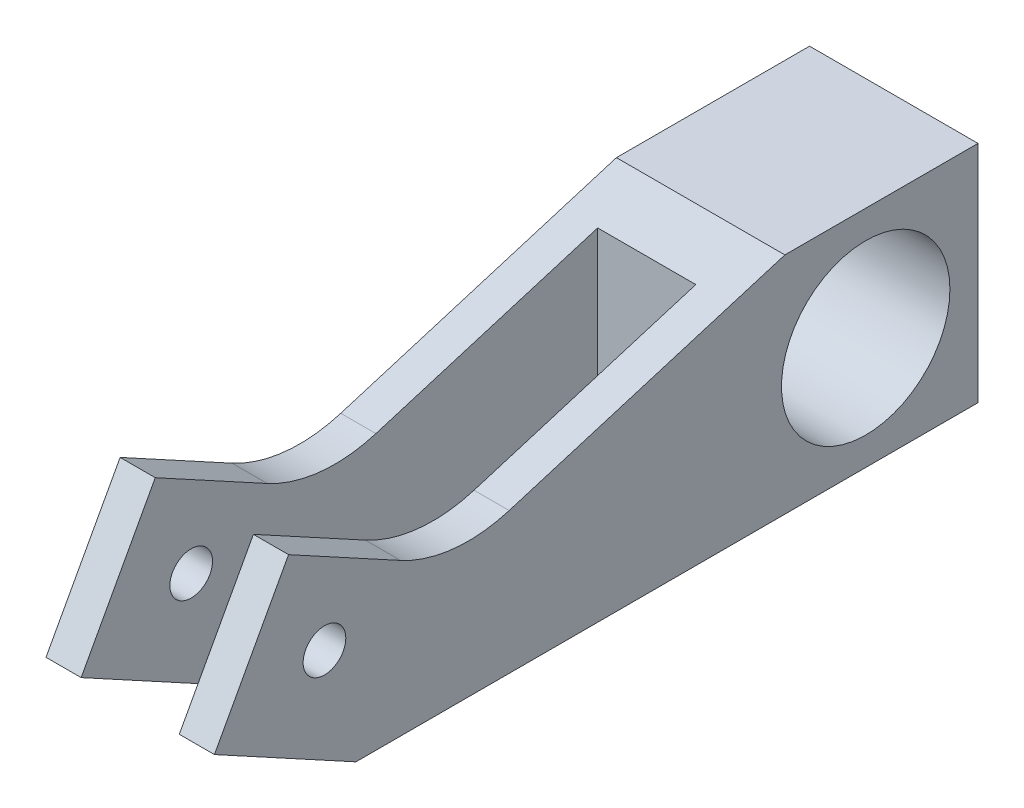
ISO-10303-21;
HEADER;
FILE_DESCRIPTION(('STEP AP214'),'2;1');
FILE_NAME('part.step','',(''),(''),'','','');
FILE_SCHEMA(('AUTOMOTIVE_DESIGN { 1 0 10303 214 1 1 1 1 }'));
ENDSEC;
DATA;
#1=APPLICATION_CONTEXT('core data for automotive mechanical design processes');
#2=APPLICATION_PROTOCOL_DEFINITION('international standard','automotive_design',2000,#1);
#3=PRODUCT_CONTEXT('',#1,'mechanical');
#4=PRODUCT('Part','Part','',(#3));
#5=PRODUCT_RELATED_PRODUCT_CATEGORY('part','',(#4));
#6=PRODUCT_DEFINITION_FORMATION('','',#4);
#7=PRODUCT_DEFINITION_CONTEXT('part definition',#1,'design');
#8=PRODUCT_DEFINITION('design','',#6,#7);
#9=PRODUCT_DEFINITION_SHAPE('','',#8);
#10=(LENGTH_UNIT() NAMED_UNIT(*) SI_UNIT(.MILLI.,.METRE.));
#11=(NAMED_UNIT(*) PLANE_ANGLE_UNIT() SI_UNIT($,.RADIAN.));
#12=(NAMED_UNIT(*) SI_UNIT($,.STERADIAN.) SOLID_ANGLE_UNIT());
#13=UNCERTAINTY_MEASURE_WITH_UNIT(LENGTH_MEASURE(1.E-05),#10,'distance_accuracy_value','');
#14=(GEOMETRIC_REPRESENTATION_CONTEXT(3) GLOBAL_UNCERTAINTY_ASSIGNED_CONTEXT((#13)) GLOBAL_UNIT_ASSIGNED_CONTEXT((#10,
#11,#12)) REPRESENTATION_CONTEXT('',''));
#15=CARTESIAN_POINT('',(0.,0.,0.));
#16=DIRECTION('',(0.,0.,1.));
#17=DIRECTION('',(1.,0.,0.));
#18=AXIS2_PLACEMENT_3D('',#15,#16,#17);
#19=CARTESIAN_POINT('',(9.525,0.,-42.418));
#20=DIRECTION('',(0.,0.,-1.));
#21=DIRECTION('',(-1.,0.,0.));
#22=AXIS2_PLACEMENT_3D('',#19,#20,#21);
#23=PLANE('',#22);
#24=DIRECTION('',(-1.,0.,0.));
#25=VECTOR('',#24,1.);
#26=CARTESIAN_POINT('',(9.525,23.5527150392203,-42.418));
#27=LINE('',#26,#25);
#28=CARTESIAN_POINT('',(5.5499,23.5527150392203,-42.418));
#29=VERTEX_POINT('',#28);
#30=CARTESIAN_POINT('',(-5.5499,23.5527150392203,-42.418));
#31=VERTEX_POINT('',#30);
#32=EDGE_CURVE('E57',#29,#31,#27,.T.);
#33=ORIENTED_EDGE('',*,*,#32,.T.);
#34=DIRECTION('',(0.,-1.,0.));
#35=VECTOR('',#34,1.);
#36=CARTESIAN_POINT('',(-5.5499,0.,-42.418));
#37=LINE('',#36,#35);
#38=CARTESIAN_POINT('',(-5.5499,0.,-42.418));
#39=VERTEX_POINT('',#38);
#40=EDGE_CURVE('E52',#31,#39,#37,.T.);
#41=ORIENTED_EDGE('',*,*,#40,.T.);
#42=DIRECTION('',(-1.,0.,0.));
#43=VECTOR('',#42,1.);
#44=CARTESIAN_POINT('',(9.525,0.,-42.418));
#45=LINE('',#44,#43);
#46=CARTESIAN_POINT('',(5.5499,0.,-42.418));
#47=VERTEX_POINT('',#46);
#48=EDGE_CURVE('E270',#47,#39,#45,.T.);
#49=ORIENTED_EDGE('',*,*,#48,.F.);
#50=DIRECTION('',(0.,-1.,0.));
#51=VECTOR('',#50,1.);
#52=CARTESIAN_POINT('',(5.5499,0.,-42.418));
#53=LINE('',#52,#51);
#54=EDGE_CURVE('E206',#29,#47,#53,.T.);
#55=ORIENTED_EDGE('',*,*,#54,.F.);
#56=EDGE_LOOP('',(#33,#41,#49,#55));
#57=FACE_BOUND('',#56,.T.);
#58=ADVANCED_FACE('F35',(#57),#23,.F.);
#59=CARTESIAN_POINT('',(9.525,0.,0.));
#60=DIRECTION('',(0.,1.,0.));
#61=DIRECTION('',(0.,0.,1.));
#62=AXIS2_PLACEMENT_3D('',#59,#60,#61);
#63=PLANE('',#62);
#64=DIRECTION('',(0.,0.,-1.));
#65=VECTOR('',#64,1.);
#66=CARTESIAN_POINT('',(-9.525,0.,0.));
#67=LINE('',#66,#65);
#68=CARTESIAN_POINT('',(-9.525,0.,0.));
#69=VERTEX_POINT('',#68);
#70=CARTESIAN_POINT('',(-9.525,0.,-70.358));
#71=VERTEX_POINT('',#70);
#72=EDGE_CURVE('E273',#69,#71,#67,.T.);
#73=ORIENTED_EDGE('',*,*,#72,.T.);
#74=DIRECTION('',(-1.,0.,0.));
#75=VECTOR('',#74,1.);
#76=CARTESIAN_POINT('',(9.525,0.,-70.358));
#77=LINE('',#76,#75);
#78=CARTESIAN_POINT('',(9.525,0.,-70.358));
#79=VERTEX_POINT('',#78);
#80=EDGE_CURVE('E11',#79,#71,#77,.T.);
#81=ORIENTED_EDGE('',*,*,#80,.F.);
#82=DIRECTION('',(0.,0.,-1.));
#83=VECTOR('',#82,1.);
#84=CARTESIAN_POINT('',(9.525,0.,0.));
#85=LINE('',#84,#83);
#86=CARTESIAN_POINT('',(9.525,0.,0.));
#87=VERTEX_POINT('',#86);
#88=EDGE_CURVE('E261',#87,#79,#85,.T.);
#89=ORIENTED_EDGE('',*,*,#88,.F.);
#90=DIRECTION('',(1.,0.,0.));
#91=VECTOR('',#90,1.);
#92=CARTESIAN_POINT('',(5.5499,0.,0.));
#93=LINE('',#92,#91);
#94=CARTESIAN_POINT('',(5.5499,0.,0.));
#95=VERTEX_POINT('',#94);
#96=EDGE_CURVE('E247',#95,#87,#93,.T.);
#97=ORIENTED_EDGE('',*,*,#96,.F.);
#98=DIRECTION('',(0.,0.,-1.));
#99=VECTOR('',#98,1.);
#100=CARTESIAN_POINT('',(5.5499,0.,0.));
#101=LINE('',#100,#99);
#102=EDGE_CURVE('E199',#95,#47,#101,.T.);
#103=ORIENTED_EDGE('',*,*,#102,.T.);
#104=ORIENTED_EDGE('',*,*,#48,.T.);
#105=DIRECTION('',(0.,0.,-1.));
#106=VECTOR('',#105,1.);
#107=CARTESIAN_POINT('',(-5.5499,0.,0.));
#108=LINE('',#107,#106);
#109=CARTESIAN_POINT('',(-5.5499,0.,0.));
#110=VERTEX_POINT('',#109);
#111=EDGE_CURVE('E311',#110,#39,#108,.T.);
#112=ORIENTED_EDGE('',*,*,#111,.F.);
#113=DIRECTION('',(-1.,0.,0.));
#114=VECTOR('',#113,1.);
#115=CARTESIAN_POINT('',(-5.5499,0.,0.));
#116=LINE('',#115,#114);
#117=EDGE_CURVE('E173',#110,#69,#116,.T.);
#118=ORIENTED_EDGE('',*,*,#117,.T.);
#119=EDGE_LOOP('',(#73,#81,#89,#97,#103,#104,#112,#118));
#120=FACE_BOUND('',#119,.T.);
#121=ADVANCED_FACE('F312',(#120),#63,.F.);
#122=CARTESIAN_POINT('',(9.525,0.,-70.358));
#123=DIRECTION('',(0.,0.,1.));
#124=DIRECTION('',(1.,0.,0.));
#125=AXIS2_PLACEMENT_3D('',#122,#123,#124);
#126=PLANE('',#125);
#127=DIRECTION('',(0.,1.,0.));
#128=VECTOR('',#127,1.);
#129=CARTESIAN_POINT('',(-9.525,0.,-70.358));
#130=LINE('',#129,#128);
#131=CARTESIAN_POINT('',(-9.525,25.4,-70.358));
#132=VERTEX_POINT('',#131);
#133=EDGE_CURVE('E276',#71,#132,#130,.T.);
#134=ORIENTED_EDGE('',*,*,#133,.T.);
#135=DIRECTION('',(-1.,0.,0.));
#136=VECTOR('',#135,1.);
#137=CARTESIAN_POINT('',(9.525,25.4,-70.358));
#138=LINE('',#137,#136);
#139=CARTESIAN_POINT('',(9.525,25.4,-70.358));
#140=VERTEX_POINT('',#139);
#141=EDGE_CURVE('E44',#140,#132,#138,.T.);
#142=ORIENTED_EDGE('',*,*,#141,.F.);
#143=DIRECTION('',(0.,1.,0.));
#144=VECTOR('',#143,1.);
#145=CARTESIAN_POINT('',(9.525,0.,-70.358));
#146=LINE('',#145,#144);
#147=EDGE_CURVE('E264',#79,#140,#146,.T.);
#148=ORIENTED_EDGE('',*,*,#147,.F.);
#149=ORIENTED_EDGE('',*,*,#80,.T.);
#150=EDGE_LOOP('',(#134,#142,#148,#149));
#151=FACE_BOUND('',#150,.T.);
#152=ADVANCED_FACE('F332',(#151),#126,.F.);
#153=CARTESIAN_POINT('',(9.525,25.4,0.));
#154=DIRECTION('',(0.,-1.,0.));
#155=DIRECTION('',(0.,0.,-1.));
#156=AXIS2_PLACEMENT_3D('',#153,#154,#155);
#157=PLANE('',#156);
#158=DIRECTION('',(0.,0.,1.));
#159=VECTOR('',#158,1.);
#160=CARTESIAN_POINT('',(-9.525,25.4,0.));
#161=LINE('',#160,#159);
#162=CARTESIAN_POINT('',(-9.525,25.4,-48.514));
#163=VERTEX_POINT('',#162);
#164=EDGE_CURVE('E278',#132,#163,#161,.T.);
#165=ORIENTED_EDGE('',*,*,#164,.T.);
#166=DIRECTION('',(-1.,0.,0.));
#167=VECTOR('',#166,1.);
#168=CARTESIAN_POINT('',(9.525,25.4,-48.514));
#169=LINE('',#168,#167);
#170=CARTESIAN_POINT('',(9.525,25.4,-48.514));
#171=VERTEX_POINT('',#170);
#172=EDGE_CURVE('E286',#171,#163,#169,.T.);
#173=ORIENTED_EDGE('',*,*,#172,.F.);
#174=DIRECTION('',(0.,0.,1.));
#175=VECTOR('',#174,1.);
#176=CARTESIAN_POINT('',(9.525,25.4,0.));
#177=LINE('',#176,#175);
#178=EDGE_CURVE('E266',#140,#171,#177,.T.);
#179=ORIENTED_EDGE('',*,*,#178,.F.);
#180=ORIENTED_EDGE('',*,*,#141,.T.);
#181=EDGE_LOOP('',(#165,#173,#179,#180));
#182=FACE_BOUND('',#181,.T.);
#183=ADVANCED_FACE('F338',(#182),#157,.F.);
#184=CARTESIAN_POINT('',(9.525,9.79887384204515,2.9693753741777));
#185=DIRECTION('',(0.,-0.957023871390544,-0.290009154318715));
#186=DIRECTION('',(0.,0.290009154318715,-0.957023871390544));
#187=AXIS2_PLACEMENT_3D('',#184,#185,#186);
#188=PLANE('',#187);
#189=DIRECTION('',(0.,-0.290009154318715,0.957023871390544));
#190=VECTOR('',#189,1.);
#191=CARTESIAN_POINT('',(-9.525,9.79887384204515,2.9693753741777));
#192=LINE('',#191,#190);
#193=CARTESIAN_POINT('',(-9.525,15.9511132303887,-17.3328801562917));
#194=VERTEX_POINT('',#193);
#195=EDGE_CURVE('E155',#163,#194,#192,.T.);
#196=ORIENTED_EDGE('',*,*,#195,.T.);
#197=DIRECTION('',(-1.,0.,0.));
#198=VECTOR('',#197,1.);
#199=CARTESIAN_POINT('',(-5.5499,15.9511132303887,-17.3328801562917));
#200=LINE('',#199,#198);
#201=CARTESIAN_POINT('',(-5.5499,15.9511132303887,-17.3328801562917));
#202=VERTEX_POINT('',#201);
#203=EDGE_CURVE('E151',#202,#194,#200,.T.);
#204=ORIENTED_EDGE('',*,*,#203,.F.);
#205=DIRECTION('',(0.,-0.290009154318715,0.957023871390544));
#206=VECTOR('',#205,1.);
#207=CARTESIAN_POINT('',(-5.5499,9.79887384204515,2.9693753741777));
#208=LINE('',#207,#206);
#209=EDGE_CURVE('E141',#31,#202,#208,.T.);
#210=ORIENTED_EDGE('',*,*,#209,.F.);
#211=ORIENTED_EDGE('',*,*,#32,.F.);
#212=DIRECTION('',(0.,-0.290009154318715,0.957023871390544));
#213=VECTOR('',#212,1.);
#214=CARTESIAN_POINT('',(5.5499,9.79887384204515,2.9693753741777));
#215=LINE('',#214,#213);
#216=CARTESIAN_POINT('',(5.5499,15.9511132303887,-17.3328801562917));
#217=VERTEX_POINT('',#216);
#218=EDGE_CURVE('E210',#29,#217,#215,.T.);
#219=ORIENTED_EDGE('',*,*,#218,.T.);
#220=DIRECTION('',(1.,0.,0.));
#221=VECTOR('',#220,1.);
#222=CARTESIAN_POINT('',(5.5499,15.9511132303887,-17.3328801562917));
#223=LINE('',#222,#221);
#224=CARTESIAN_POINT('',(9.525,15.9511132303887,-17.3328801562917));
#225=VERTEX_POINT('',#224);
#226=EDGE_CURVE('E233',#217,#225,#223,.T.);
#227=ORIENTED_EDGE('',*,*,#226,.T.);
#228=DIRECTION('',(0.,-0.290009154318715,0.957023871390544));
#229=VECTOR('',#228,1.);
#230=CARTESIAN_POINT('',(9.525,9.79887384204515,2.9693753741777));
#231=LINE('',#230,#229);
#232=EDGE_CURVE('E268',#171,#225,#231,.T.);
#233=ORIENTED_EDGE('',*,*,#232,.F.);
#234=ORIENTED_EDGE('',*,*,#172,.T.);
#235=EDGE_LOOP('',(#196,#204,#210,#211,#219,#227,#233,#234));
#236=FACE_BOUND('',#235,.T.);
#237=ADVANCED_FACE('F152',(#236),#188,.F.);
#238=CARTESIAN_POINT('',(9.525,12.7,-57.658));
#239=DIRECTION('',(-1.,0.,0.));
#240=DIRECTION('',(0.,0.,1.));
#241=AXIS2_PLACEMENT_3D('',#238,#239,#240);
#242=CYLINDRICAL_SURFACE('',#241,9.52500000000001);
#243=CARTESIAN_POINT('',(9.525,12.7,-57.658));
#244=DIRECTION('',(1.,0.,0.));
#245=DIRECTION('',(0.,0.,-1.));
#246=AXIS2_PLACEMENT_3D('',#243,#244,#245);
#247=CIRCLE('',#246,9.52500000000001);
#248=CARTESIAN_POINT('',(9.525,12.7,-67.183));
#249=VERTEX_POINT('',#248);
#250=EDGE_CURVE('E258',#249,#249,#247,.T.);
#251=ORIENTED_EDGE('',*,*,#250,.T.);
#252=EDGE_LOOP('',(#251));
#253=FACE_BOUND('',#252,.T.);
#254=CARTESIAN_POINT('',(-9.525,12.7,-57.658));
#255=DIRECTION('',(1.,0.,0.));
#256=DIRECTION('',(0.,0.,-1.));
#257=AXIS2_PLACEMENT_3D('',#254,#255,#256);
#258=CIRCLE('',#257,9.52500000000001);
#259=CARTESIAN_POINT('',(-9.525,12.7,-67.183));
#260=VERTEX_POINT('',#259);
#261=EDGE_CURVE('E250',#260,#260,#258,.T.);
#262=ORIENTED_EDGE('',*,*,#261,.F.);
#263=EDGE_LOOP('',(#262));
#264=FACE_BOUND('',#263,.T.);
#265=ADVANCED_FACE('F37',(#253,#264),#242,.F.);
#266=CARTESIAN_POINT('',(9.525,0.,0.));
#267=DIRECTION('',(1.,0.,0.));
#268=DIRECTION('',(0.,0.,-1.));
#269=AXIS2_PLACEMENT_3D('',#266,#267,#268);
#270=PLANE('',#269);
#271=ORIENTED_EDGE('',*,*,#250,.F.);
#272=EDGE_LOOP('',(#271));
#273=FACE_BOUND('',#272,.T.);
#274=ORIENTED_EDGE('',*,*,#88,.T.);
#275=ORIENTED_EDGE('',*,*,#147,.T.);
#276=ORIENTED_EDGE('',*,*,#178,.T.);
#277=ORIENTED_EDGE('',*,*,#232,.T.);
#278=CARTESIAN_POINT('',(9.525,31.2654092203801,-12.6921536688836));
#279=DIRECTION('',(1.,0.,0.));
#280=DIRECTION('',(0.,0.,-1.));
#281=AXIS2_PLACEMENT_3D('',#278,#279,#280);
#282=CIRCLE('',#281,16.002);
#283=CARTESIAN_POINT('',(9.525,17.2121676531045,-5.03902323410091));
#284=VERTEX_POINT('',#283);
#285=EDGE_CURVE('E236',#225,#284,#282,.F.);
#286=ORIENTED_EDGE('',*,*,#285,.T.);
#287=DIRECTION('',(0.,0.478260869565218,0.878217820727137));
#288=VECTOR('',#287,1.);
#289=CARTESIAN_POINT('',(9.525,15.3916455260638,-8.38200000000001));
#290=LINE('',#289,#288);
#291=CARTESIAN_POINT('',(9.525,24.1060330665558,7.61999999999999));
#292=VERTEX_POINT('',#291);
#293=EDGE_CURVE('E239',#284,#292,#290,.T.);
#294=ORIENTED_EDGE('',*,*,#293,.T.);
#295=DIRECTION('',(0.,-0.878217820727137,0.478260869565218));
#296=VECTOR('',#295,1.);
#297=CARTESIAN_POINT('',(9.525,8.71438754049202,16.002));
#298=LINE('',#297,#296);
#299=CARTESIAN_POINT('',(9.525,8.71438754049202,16.002));
#300=VERTEX_POINT('',#299);
#301=EDGE_CURVE('E242',#292,#300,#298,.T.);
#302=ORIENTED_EDGE('',*,*,#301,.T.);
#303=DIRECTION('',(0.,-0.478260869565218,-0.878217820727137));
#304=VECTOR('',#303,1.);
#305=CARTESIAN_POINT('',(9.525,0.,0.));
#306=LINE('',#305,#304);
#307=EDGE_CURVE('E200',#300,#87,#306,.T.);
#308=ORIENTED_EDGE('',*,*,#307,.T.);
#309=EDGE_LOOP('',(#274,#275,#276,#277,#286,#294,#302,#308));
#310=FACE_BOUND('',#309,.T.);
#311=CARTESIAN_POINT('',(9.525,12.7,3.556));
#312=DIRECTION('',(1.,0.,0.));
#313=DIRECTION('',(0.,0.,-1.));
#314=AXIS2_PLACEMENT_3D('',#311,#312,#313);
#315=CIRCLE('',#314,2.413);
#316=CARTESIAN_POINT('',(9.525,12.7,1.143));
#317=VERTEX_POINT('',#316);
#318=EDGE_CURVE('E158',#317,#317,#315,.T.);
#319=ORIENTED_EDGE('',*,*,#318,.F.);
#320=EDGE_LOOP('',(#319));
#321=FACE_BOUND('',#320,.T.);
#322=ADVANCED_FACE('F348',(#273,#310,#321),#270,.T.);
#323=CARTESIAN_POINT('',(-9.525,0.,0.));
#324=DIRECTION('',(1.,0.,0.));
#325=DIRECTION('',(0.,0.,-1.));
#326=AXIS2_PLACEMENT_3D('',#323,#324,#325);
#327=PLANE('',#326);
#328=ORIENTED_EDGE('',*,*,#261,.T.);
#329=EDGE_LOOP('',(#328));
#330=FACE_BOUND('',#329,.T.);
#331=ORIENTED_EDGE('',*,*,#72,.F.);
#332=DIRECTION('',(0.,-0.478260869565218,-0.878217820727137));
#333=VECTOR('',#332,1.);
#334=CARTESIAN_POINT('',(-9.525,0.,0.));
#335=LINE('',#334,#333);
#336=CARTESIAN_POINT('',(-9.525,8.71438754049202,16.002));
#337=VERTEX_POINT('',#336);
#338=EDGE_CURVE('E183',#337,#69,#335,.T.);
#339=ORIENTED_EDGE('',*,*,#338,.F.);
#340=DIRECTION('',(0.,-0.878217820727137,0.478260869565218));
#341=VECTOR('',#340,1.);
#342=CARTESIAN_POINT('',(-9.525,8.71438754049202,16.002));
#343=LINE('',#342,#341);
#344=CARTESIAN_POINT('',(-9.525,24.1060330665558,7.61999999999999));
#345=VERTEX_POINT('',#344);
#346=EDGE_CURVE('E181',#345,#337,#343,.T.);
#347=ORIENTED_EDGE('',*,*,#346,.F.);
#348=DIRECTION('',(0.,0.478260869565218,0.878217820727137));
#349=VECTOR('',#348,1.);
#350=CARTESIAN_POINT('',(-9.525,15.3916455260638,-8.38200000000001));
#351=LINE('',#350,#349);
#352=CARTESIAN_POINT('',(-9.525,17.2121676531045,-5.03902323410091));
#353=VERTEX_POINT('',#352);
#354=EDGE_CURVE('E179',#353,#345,#351,.T.);
#355=ORIENTED_EDGE('',*,*,#354,.F.);
#356=CARTESIAN_POINT('',(-9.525,31.2654092203801,-12.6921536688836));
#357=DIRECTION('',(1.,0.,0.));
#358=DIRECTION('',(0.,0.,-1.));
#359=AXIS2_PLACEMENT_3D('',#356,#357,#358);
#360=CIRCLE('',#359,16.002);
#361=EDGE_CURVE('E177',#194,#353,#360,.F.);
#362=ORIENTED_EDGE('',*,*,#361,.F.);
#363=ORIENTED_EDGE('',*,*,#195,.F.);
#364=ORIENTED_EDGE('',*,*,#164,.F.);
#365=ORIENTED_EDGE('',*,*,#133,.F.);
#366=EDGE_LOOP('',(#331,#339,#347,#355,#362,#363,#364,#365));
#367=FACE_BOUND('',#366,.T.);
#368=CARTESIAN_POINT('',(-9.525,12.7,3.556));
#369=DIRECTION('',(1.,0.,0.));
#370=DIRECTION('',(0.,0.,-1.));
#371=AXIS2_PLACEMENT_3D('',#368,#369,#370);
#372=CIRCLE('',#371,2.413);
#373=CARTESIAN_POINT('',(-9.525,12.7,1.143));
#374=VERTEX_POINT('',#373);
#375=EDGE_CURVE('E174',#374,#374,#372,.T.);
#376=ORIENTED_EDGE('',*,*,#375,.T.);
#377=EDGE_LOOP('',(#376));
#378=FACE_BOUND('',#377,.T.);
#379=ADVANCED_FACE('F293',(#330,#367,#378),#327,.F.);
#380=CARTESIAN_POINT('',(5.5499,0.,0.));
#381=DIRECTION('',(0.,-0.878217820727137,0.478260869565218));
#382=DIRECTION('',(0.,-0.478260869565218,-0.878217820727137));
#383=AXIS2_PLACEMENT_3D('',#380,#381,#382);
#384=PLANE('',#383);
#385=ORIENTED_EDGE('',*,*,#307,.F.);
#386=DIRECTION('',(1.,0.,0.));
#387=VECTOR('',#386,1.);
#388=CARTESIAN_POINT('',(5.5499,8.71438754049202,16.002));
#389=LINE('',#388,#387);
#390=CARTESIAN_POINT('',(5.5499,8.71438754049202,16.002));
#391=VERTEX_POINT('',#390);
#392=EDGE_CURVE('E251',#391,#300,#389,.T.);
#393=ORIENTED_EDGE('',*,*,#392,.F.);
#394=DIRECTION('',(0.,-0.478260869565218,-0.878217820727137));
#395=VECTOR('',#394,1.);
#396=CARTESIAN_POINT('',(5.5499,0.,0.));
#397=LINE('',#396,#395);
#398=EDGE_CURVE('E228',#391,#95,#397,.T.);
#399=ORIENTED_EDGE('',*,*,#398,.T.);
#400=ORIENTED_EDGE('',*,*,#96,.T.);
#401=EDGE_LOOP('',(#385,#393,#399,#400));
#402=FACE_BOUND('',#401,.T.);
#403=ADVANCED_FACE('F353',(#402),#384,.T.);
#404=CARTESIAN_POINT('',(5.5499,8.71438754049202,16.002));
#405=DIRECTION('',(0.,0.478260869565218,0.878217820727137));
#406=DIRECTION('',(0.,-0.878217820727137,0.478260869565218));
#407=AXIS2_PLACEMENT_3D('',#404,#405,#406);
#408=PLANE('',#407);
#409=ORIENTED_EDGE('',*,*,#301,.F.);
#410=DIRECTION('',(1.,0.,0.));
#411=VECTOR('',#410,1.);
#412=CARTESIAN_POINT('',(5.5499,24.1060330665558,7.61999999999999));
#413=LINE('',#412,#411);
#414=CARTESIAN_POINT('',(5.5499,24.1060330665558,7.61999999999999));
#415=VERTEX_POINT('',#414);
#416=EDGE_CURVE('E253',#415,#292,#413,.T.);
#417=ORIENTED_EDGE('',*,*,#416,.F.);
#418=DIRECTION('',(0.,-0.878217820727137,0.478260869565218));
#419=VECTOR('',#418,1.);
#420=CARTESIAN_POINT('',(5.5499,8.71438754049202,16.002));
#421=LINE('',#420,#419);
#422=EDGE_CURVE('E224',#415,#391,#421,.T.);
#423=ORIENTED_EDGE('',*,*,#422,.T.);
#424=ORIENTED_EDGE('',*,*,#392,.T.);
#425=EDGE_LOOP('',(#409,#417,#423,#424));
#426=FACE_BOUND('',#425,.T.);
#427=ADVANCED_FACE('F360',(#426),#408,.T.);
#428=CARTESIAN_POINT('',(5.5499,15.3916455260638,-8.38200000000001));
#429=DIRECTION('',(0.,0.878217820727137,-0.478260869565218));
#430=DIRECTION('',(0.,0.478260869565218,0.878217820727137));
#431=AXIS2_PLACEMENT_3D('',#428,#429,#430);
#432=PLANE('',#431);
#433=ORIENTED_EDGE('',*,*,#293,.F.);
#434=DIRECTION('',(1.,0.,0.));
#435=VECTOR('',#434,1.);
#436=CARTESIAN_POINT('',(5.5499,17.2121676531045,-5.03902323410091));
#437=LINE('',#436,#435);
#438=CARTESIAN_POINT('',(5.5499,17.2121676531045,-5.03902323410091));
#439=VERTEX_POINT('',#438);
#440=EDGE_CURVE('E255',#439,#284,#437,.T.);
#441=ORIENTED_EDGE('',*,*,#440,.F.);
#442=DIRECTION('',(0.,0.478260869565218,0.878217820727137));
#443=VECTOR('',#442,1.);
#444=CARTESIAN_POINT('',(5.5499,15.3916455260638,-8.38200000000001));
#445=LINE('',#444,#443);
#446=EDGE_CURVE('E220',#439,#415,#445,.T.);
#447=ORIENTED_EDGE('',*,*,#446,.T.);
#448=ORIENTED_EDGE('',*,*,#416,.T.);
#449=EDGE_LOOP('',(#433,#441,#447,#448));
#450=FACE_BOUND('',#449,.T.);
#451=ADVANCED_FACE('F362',(#450),#432,.T.);
#452=CARTESIAN_POINT('',(5.5499,31.2654092203801,-12.6921536688836));
#453=DIRECTION('',(1.,0.,0.));
#454=DIRECTION('',(0.,0.,-1.));
#455=AXIS2_PLACEMENT_3D('',#452,#453,#454);
#456=CYLINDRICAL_SURFACE('',#455,16.002);
#457=ORIENTED_EDGE('',*,*,#285,.F.);
#458=ORIENTED_EDGE('',*,*,#226,.F.);
#459=CARTESIAN_POINT('',(5.5499,31.2654092203801,-12.6921536688836));
#460=DIRECTION('',(1.,0.,0.));
#461=DIRECTION('',(0.,0.,-1.));
#462=AXIS2_PLACEMENT_3D('',#459,#460,#461);
#463=CIRCLE('',#462,16.002);
#464=EDGE_CURVE('E203',#217,#439,#463,.F.);
#465=ORIENTED_EDGE('',*,*,#464,.T.);
#466=ORIENTED_EDGE('',*,*,#440,.T.);
#467=EDGE_LOOP('',(#457,#458,#465,#466));
#468=FACE_BOUND('',#467,.T.);
#469=ADVANCED_FACE('F364',(#468),#456,.F.);
#470=CARTESIAN_POINT('',(5.5499,12.7,3.556));
#471=DIRECTION('',(1.,0.,0.));
#472=DIRECTION('',(0.,0.,-1.));
#473=AXIS2_PLACEMENT_3D('',#470,#471,#472);
#474=CYLINDRICAL_SURFACE('',#473,2.413);
#475=CARTESIAN_POINT('',(5.5499,12.7,3.556));
#476=DIRECTION('',(1.,0.,0.));
#477=DIRECTION('',(0.,0.,-1.));
#478=AXIS2_PLACEMENT_3D('',#475,#476,#477);
#479=CIRCLE('',#478,2.413);
#480=CARTESIAN_POINT('',(5.5499,12.7,1.143));
#481=VERTEX_POINT('',#480);
#482=EDGE_CURVE('E196',#481,#481,#479,.T.);
#483=ORIENTED_EDGE('',*,*,#482,.F.);
#484=EDGE_LOOP('',(#483));
#485=FACE_BOUND('',#484,.T.);
#486=ORIENTED_EDGE('',*,*,#318,.T.);
#487=EDGE_LOOP('',(#486));
#488=FACE_BOUND('',#487,.T.);
#489=ADVANCED_FACE('F366',(#485,#488),#474,.F.);
#490=CARTESIAN_POINT('',(5.5499,0.,0.));
#491=DIRECTION('',(1.,0.,0.));
#492=DIRECTION('',(0.,0.,-1.));
#493=AXIS2_PLACEMENT_3D('',#490,#491,#492);
#494=PLANE('',#493);
#495=ORIENTED_EDGE('',*,*,#482,.T.);
#496=EDGE_LOOP('',(#495));
#497=FACE_BOUND('',#496,.T.);
#498=ORIENTED_EDGE('',*,*,#102,.F.);
#499=ORIENTED_EDGE('',*,*,#398,.F.);
#500=ORIENTED_EDGE('',*,*,#422,.F.);
#501=ORIENTED_EDGE('',*,*,#446,.F.);
#502=ORIENTED_EDGE('',*,*,#464,.F.);
#503=ORIENTED_EDGE('',*,*,#218,.F.);
#504=ORIENTED_EDGE('',*,*,#54,.T.);
#505=EDGE_LOOP('',(#498,#499,#500,#501,#502,#503,#504));
#506=FACE_BOUND('',#505,.T.);
#507=ADVANCED_FACE('F357',(#497,#506),#494,.F.);
#508=CARTESIAN_POINT('',(-5.5499,31.2654092203801,-12.6921536688836));
#509=DIRECTION('',(-1.,0.,0.));
#510=DIRECTION('',(0.,0.,1.));
#511=AXIS2_PLACEMENT_3D('',#508,#509,#510);
#512=CYLINDRICAL_SURFACE('',#511,16.002);
#513=ORIENTED_EDGE('',*,*,#361,.T.);
#514=DIRECTION('',(-1.,0.,0.));
#515=VECTOR('',#514,1.);
#516=CARTESIAN_POINT('',(-5.5499,17.2121676531045,-5.03902323410091));
#517=LINE('',#516,#515);
#518=CARTESIAN_POINT('',(-5.5499,17.2121676531045,-5.03902323410091));
#519=VERTEX_POINT('',#518);
#520=EDGE_CURVE('E159',#519,#353,#517,.T.);
#521=ORIENTED_EDGE('',*,*,#520,.F.);
#522=CARTESIAN_POINT('',(-5.5499,31.2654092203801,-12.6921536688836));
#523=DIRECTION('',(1.,0.,0.));
#524=DIRECTION('',(0.,0.,-1.));
#525=AXIS2_PLACEMENT_3D('',#522,#523,#524);
#526=CIRCLE('',#525,16.002);
#527=EDGE_CURVE('E146',#202,#519,#526,.F.);
#528=ORIENTED_EDGE('',*,*,#527,.F.);
#529=ORIENTED_EDGE('',*,*,#203,.T.);
#530=EDGE_LOOP('',(#513,#521,#528,#529));
#531=FACE_BOUND('',#530,.T.);
#532=ADVANCED_FACE('F161',(#531),#512,.F.);
#533=CARTESIAN_POINT('',(-5.5499,15.3916455260638,-8.38200000000001));
#534=DIRECTION('',(0.,-0.878217820727137,0.478260869565218));
#535=DIRECTION('',(0.,-0.478260869565218,-0.878217820727137));
#536=AXIS2_PLACEMENT_3D('',#533,#534,#535);
#537=PLANE('',#536);
#538=ORIENTED_EDGE('',*,*,#354,.T.);
#539=DIRECTION('',(-1.,0.,0.));
#540=VECTOR('',#539,1.);
#541=CARTESIAN_POINT('',(-5.5499,24.1060330665558,7.61999999999999));
#542=LINE('',#541,#540);
#543=CARTESIAN_POINT('',(-5.5499,24.1060330665558,7.61999999999999));
#544=VERTEX_POINT('',#543);
#545=EDGE_CURVE('E192',#544,#345,#542,.T.);
#546=ORIENTED_EDGE('',*,*,#545,.F.);
#547=DIRECTION('',(0.,0.478260869565218,0.878217820727137));
#548=VECTOR('',#547,1.);
#549=CARTESIAN_POINT('',(-5.5499,15.3916455260638,-8.38200000000001));
#550=LINE('',#549,#548);
#551=EDGE_CURVE('E164',#519,#544,#550,.T.);
#552=ORIENTED_EDGE('',*,*,#551,.F.);
#553=ORIENTED_EDGE('',*,*,#520,.T.);
#554=EDGE_LOOP('',(#538,#546,#552,#553));
#555=FACE_BOUND('',#554,.T.);
#556=ADVANCED_FACE('F298',(#555),#537,.F.);
#557=CARTESIAN_POINT('',(-5.5499,8.71438754049202,16.002));
#558=DIRECTION('',(0.,-0.478260869565218,-0.878217820727137));
#559=DIRECTION('',(0.,0.878217820727137,-0.478260869565218));
#560=AXIS2_PLACEMENT_3D('',#557,#558,#559);
#561=PLANE('',#560);
#562=ORIENTED_EDGE('',*,*,#346,.T.);
#563=DIRECTION('',(-1.,0.,0.));
#564=VECTOR('',#563,1.);
#565=CARTESIAN_POINT('',(-5.5499,8.71438754049202,16.002));
#566=LINE('',#565,#564);
#567=CARTESIAN_POINT('',(-5.5499,8.71438754049202,16.002));
#568=VERTEX_POINT('',#567);
#569=EDGE_CURVE('E189',#568,#337,#566,.T.);
#570=ORIENTED_EDGE('',*,*,#569,.F.);
#571=DIRECTION('',(0.,-0.878217820727137,0.478260869565218));
#572=VECTOR('',#571,1.);
#573=CARTESIAN_POINT('',(-5.5499,8.71438754049202,16.002));
#574=LINE('',#573,#572);
#575=EDGE_CURVE('E166',#544,#568,#574,.T.);
#576=ORIENTED_EDGE('',*,*,#575,.F.);
#577=ORIENTED_EDGE('',*,*,#545,.T.);
#578=EDGE_LOOP('',(#562,#570,#576,#577));
#579=FACE_BOUND('',#578,.T.);
#580=ADVANCED_FACE('F305',(#579),#561,.F.);
#581=CARTESIAN_POINT('',(-5.5499,12.7,3.556));
#582=DIRECTION('',(-1.,0.,0.));
#583=DIRECTION('',(0.,0.,1.));
#584=AXIS2_PLACEMENT_3D('',#581,#582,#583);
#585=CYLINDRICAL_SURFACE('',#584,2.413);
#586=CARTESIAN_POINT('',(-5.5499,12.7,3.556));
#587=DIRECTION('',(1.,0.,0.));
#588=DIRECTION('',(0.,0.,-1.));
#589=AXIS2_PLACEMENT_3D('',#586,#587,#588);
#590=CIRCLE('',#589,2.413);
#591=CARTESIAN_POINT('',(-5.5499,12.7,1.143));
#592=VERTEX_POINT('',#591);
#593=EDGE_CURVE('E186',#592,#592,#590,.T.);
#594=ORIENTED_EDGE('',*,*,#593,.T.);
#595=EDGE_LOOP('',(#594));
#596=FACE_BOUND('',#595,.T.);
#597=ORIENTED_EDGE('',*,*,#375,.F.);
#598=EDGE_LOOP('',(#597));
#599=FACE_BOUND('',#598,.T.);
#600=ADVANCED_FACE('F318',(#596,#599),#585,.F.);
#601=CARTESIAN_POINT('',(-5.5499,0.,0.));
#602=DIRECTION('',(0.,0.878217820727137,-0.478260869565218));
#603=DIRECTION('',(0.,0.478260869565218,0.878217820727137));
#604=AXIS2_PLACEMENT_3D('',#601,#602,#603);
#605=PLANE('',#604);
#606=ORIENTED_EDGE('',*,*,#338,.T.);
#607=ORIENTED_EDGE('',*,*,#117,.F.);
#608=DIRECTION('',(0.,-0.478260869565218,-0.878217820727137));
#609=VECTOR('',#608,1.);
#610=CARTESIAN_POINT('',(-5.5499,0.,0.));
#611=LINE('',#610,#609);
#612=EDGE_CURVE('E171',#568,#110,#611,.T.);
#613=ORIENTED_EDGE('',*,*,#612,.F.);
#614=ORIENTED_EDGE('',*,*,#569,.T.);
#615=EDGE_LOOP('',(#606,#607,#613,#614));
#616=FACE_BOUND('',#615,.T.);
#617=ADVANCED_FACE('F308',(#616),#605,.F.);
#618=CARTESIAN_POINT('',(-5.5499,0.,0.));
#619=DIRECTION('',(1.,0.,0.));
#620=DIRECTION('',(0.,0.,-1.));
#621=AXIS2_PLACEMENT_3D('',#618,#619,#620);
#622=PLANE('',#621);
#623=ORIENTED_EDGE('',*,*,#593,.F.);
#624=EDGE_LOOP('',(#623));
#625=FACE_BOUND('',#624,.T.);
#626=ORIENTED_EDGE('',*,*,#111,.T.);
#627=ORIENTED_EDGE('',*,*,#40,.F.);
#628=ORIENTED_EDGE('',*,*,#209,.T.);
#629=ORIENTED_EDGE('',*,*,#527,.T.);
#630=ORIENTED_EDGE('',*,*,#551,.T.);
#631=ORIENTED_EDGE('',*,*,#575,.T.);
#632=ORIENTED_EDGE('',*,*,#612,.T.);
#633=EDGE_LOOP('',(#626,#627,#628,#629,#630,#631,#632));
#634=FACE_BOUND('',#633,.T.);
#635=ADVANCED_FACE('F144',(#625,#634),#622,.T.);
#636=CLOSED_SHELL('',(#58,#121,#152,#183,#237,#265,#322,#379,#403,#427,#451,#469,#489,#507,#532,
#556,#580,#600,#617,#635));
#637=MANIFOLD_SOLID_BREP('B2',#636);
#638=ADVANCED_BREP_SHAPE_REPRESENTATION('',(#18,#637),#14);
#639=SHAPE_DEFINITION_REPRESENTATION(#9,#638);
ENDSEC;
END-ISO-10303-21;
